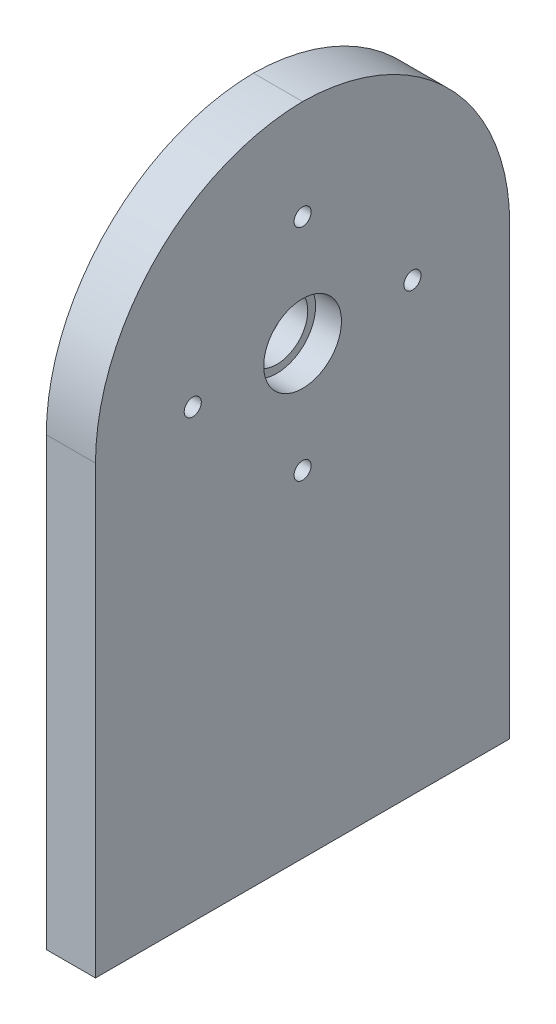
ISO-10303-21;
HEADER;
FILE_DESCRIPTION(('STEP AP214'),'2;1');
FILE_NAME('part.step','',(''),(''),'','','');
FILE_SCHEMA(('AUTOMOTIVE_DESIGN { 1 0 10303 214 1 1 1 1 }'));
ENDSEC;
DATA;
#1=APPLICATION_CONTEXT('core data for automotive mechanical design processes');
#2=APPLICATION_PROTOCOL_DEFINITION('international standard','automotive_design',2000,#1);
#3=PRODUCT_CONTEXT('',#1,'mechanical');
#4=PRODUCT('Part','Part','',(#3));
#5=PRODUCT_RELATED_PRODUCT_CATEGORY('part','',(#4));
#6=PRODUCT_DEFINITION_FORMATION('','',#4);
#7=PRODUCT_DEFINITION_CONTEXT('part definition',#1,'design');
#8=PRODUCT_DEFINITION('design','',#6,#7);
#9=PRODUCT_DEFINITION_SHAPE('','',#8);
#10=(LENGTH_UNIT() NAMED_UNIT(*) SI_UNIT(.MILLI.,.METRE.));
#11=(NAMED_UNIT(*) PLANE_ANGLE_UNIT() SI_UNIT($,.RADIAN.));
#12=(NAMED_UNIT(*) SI_UNIT($,.STERADIAN.) SOLID_ANGLE_UNIT());
#13=UNCERTAINTY_MEASURE_WITH_UNIT(LENGTH_MEASURE(1.E-05),#10,'distance_accuracy_value','');
#14=(GEOMETRIC_REPRESENTATION_CONTEXT(3) GLOBAL_UNCERTAINTY_ASSIGNED_CONTEXT((#13)) GLOBAL_UNIT_ASSIGNED_CONTEXT((#10,
#11,#12)) REPRESENTATION_CONTEXT('',''));
#15=CARTESIAN_POINT('',(0.,0.,0.));
#16=DIRECTION('',(0.,0.,1.));
#17=DIRECTION('',(1.,0.,0.));
#18=AXIS2_PLACEMENT_3D('',#15,#16,#17);
#19=CARTESIAN_POINT('',(144.666666666667,10.,39.6428499928494));
#20=DIRECTION('',(0.,1.,0.));
#21=DIRECTION('',(0.,0.,1.));
#22=AXIS2_PLACEMENT_3D('',#19,#20,#21);
#23=PLANE('',#22);
#24=CARTESIAN_POINT('',(-64.,10.,30.));
#25=DIRECTION('',(0.,-1.,0.));
#26=DIRECTION('',(0.,0.,-1.));
#27=AXIS2_PLACEMENT_3D('',#24,#25,#26);
#28=CIRCLE('',#27,1.64999999999999);
#29=CARTESIAN_POINT('',(-64.,10.,28.35));
#30=VERTEX_POINT('',#29);
#31=EDGE_CURVE('E160',#30,#30,#28,.T.);
#32=ORIENTED_EDGE('',*,*,#31,.F.);
#33=EDGE_LOOP('',(#32));
#34=FACE_BOUND('',#33,.T.);
#35=CARTESIAN_POINT('',(-64.,10.,0.));
#36=DIRECTION('',(0.,-1.,0.));
#37=DIRECTION('',(0.,0.,-1.));
#38=AXIS2_PLACEMENT_3D('',#35,#36,#37);
#39=CIRCLE('',#38,1.64999999999999);
#40=CARTESIAN_POINT('',(-64.,10.,-1.64999999999999));
#41=VERTEX_POINT('',#40);
#42=EDGE_CURVE('E168',#41,#41,#39,.T.);
#43=ORIENTED_EDGE('',*,*,#42,.F.);
#44=EDGE_LOOP('',(#43));
#45=FACE_BOUND('',#44,.T.);
#46=CARTESIAN_POINT('',(-64.,10.,-30.));
#47=DIRECTION('',(0.,-1.,0.));
#48=DIRECTION('',(0.,0.,-1.));
#49=AXIS2_PLACEMENT_3D('',#46,#47,#48);
#50=CIRCLE('',#49,1.64999999999999);
#51=CARTESIAN_POINT('',(-64.,10.,-31.65));
#52=VERTEX_POINT('',#51);
#53=EDGE_CURVE('E176',#52,#52,#50,.T.);
#54=ORIENTED_EDGE('',*,*,#53,.F.);
#55=EDGE_LOOP('',(#54));
#56=FACE_BOUND('',#55,.T.);
#57=DIRECTION('',(0.,0.,-1.));
#58=VECTOR('',#57,1.);
#59=CARTESIAN_POINT('',(-60.,10.,-40.00000001));
#60=LINE('',#59,#58);
#61=CARTESIAN_POINT('',(-60.,10.,40.00000001));
#62=VERTEX_POINT('',#61);
#63=CARTESIAN_POINT('',(-60.,10.,-40.00000001));
#64=VERTEX_POINT('',#63);
#65=EDGE_CURVE('E49',#62,#64,#60,.T.);
#66=ORIENTED_EDGE('',*,*,#65,.F.);
#67=DIRECTION('',(1.,0.,0.));
#68=VECTOR('',#67,1.);
#69=CARTESIAN_POINT('',(-68.,10.,40.00000001));
#70=LINE('',#69,#68);
#71=CARTESIAN_POINT('',(-69.5,10.,40.00000001));
#72=VERTEX_POINT('',#71);
#73=EDGE_CURVE('E102',#72,#62,#70,.T.);
#74=ORIENTED_EDGE('',*,*,#73,.F.);
#75=DIRECTION('',(0.,0.,1.));
#76=VECTOR('',#75,1.);
#77=CARTESIAN_POINT('',(-69.5,10.,-40.00000001));
#78=LINE('',#77,#76);
#79=CARTESIAN_POINT('',(-69.5,10.,-40.00000001));
#80=VERTEX_POINT('',#79);
#81=EDGE_CURVE('E105',#80,#72,#78,.T.);
#82=ORIENTED_EDGE('',*,*,#81,.F.);
#83=DIRECTION('',(-1.,0.,0.));
#84=VECTOR('',#83,1.);
#85=CARTESIAN_POINT('',(-68.,10.,-40.00000001));
#86=LINE('',#85,#84);
#87=EDGE_CURVE('E201',#64,#80,#86,.T.);
#88=ORIENTED_EDGE('',*,*,#87,.F.);
#89=EDGE_LOOP('',(#66,#74,#82,#88));
#90=FACE_BOUND('',#89,.T.);
#91=ADVANCED_FACE('F45',(#34,#45,#56,#90),#23,.F.);
#92=CARTESIAN_POINT('',(-60.,136.594137144615,0.));
#93=DIRECTION('',(1.,0.,0.));
#94=DIRECTION('',(0.,0.,-1.));
#95=AXIS2_PLACEMENT_3D('',#92,#93,#94);
#96=PLANE('',#95);
#97=CARTESIAN_POINT('',(-60.,117.330186529938,0.));
#98=DIRECTION('',(1.,0.,0.));
#99=DIRECTION('',(0.,0.,-1.));
#100=AXIS2_PLACEMENT_3D('',#97,#98,#99);
#101=CIRCLE('',#100,1.65);
#102=CARTESIAN_POINT('',(-60.,117.330186529938,-1.64999999999997));
#103=VERTEX_POINT('',#102);
#104=EDGE_CURVE('E144',#103,#103,#101,.T.);
#105=ORIENTED_EDGE('',*,*,#104,.F.);
#106=EDGE_LOOP('',(#105));
#107=FACE_BOUND('',#106,.T.);
#108=CARTESIAN_POINT('',(-60.,74.9037796587448,0.));
#109=DIRECTION('',(1.,0.,0.));
#110=DIRECTION('',(0.,0.,-1.));
#111=AXIS2_PLACEMENT_3D('',#108,#109,#110);
#112=CIRCLE('',#111,1.65);
#113=CARTESIAN_POINT('',(-60.,74.9037796587448,-1.64999999999997));
#114=VERTEX_POINT('',#113);
#115=EDGE_CURVE('E148',#114,#114,#112,.T.);
#116=ORIENTED_EDGE('',*,*,#115,.F.);
#117=EDGE_LOOP('',(#116));
#118=FACE_BOUND('',#117,.T.);
#119=CARTESIAN_POINT('',(-60.,96.1169830943412,-21.2132034355964));
#120=DIRECTION('',(1.,0.,0.));
#121=DIRECTION('',(0.,0.,-1.));
#122=AXIS2_PLACEMENT_3D('',#119,#120,#121);
#123=CIRCLE('',#122,1.65);
#124=CARTESIAN_POINT('',(-60.,96.1169830943412,-22.8632034355964));
#125=VERTEX_POINT('',#124);
#126=EDGE_CURVE('E152',#125,#125,#123,.T.);
#127=ORIENTED_EDGE('',*,*,#126,.F.);
#128=EDGE_LOOP('',(#127));
#129=FACE_BOUND('',#128,.T.);
#130=CARTESIAN_POINT('',(-60.,96.1169830943412,21.2132034355964));
#131=DIRECTION('',(1.,0.,0.));
#132=DIRECTION('',(0.,0.,-1.));
#133=AXIS2_PLACEMENT_3D('',#130,#131,#132);
#134=CIRCLE('',#133,1.65);
#135=CARTESIAN_POINT('',(-60.,96.1169830943412,19.5632034355964));
#136=VERTEX_POINT('',#135);
#137=EDGE_CURVE('E156',#136,#136,#134,.T.);
#138=ORIENTED_EDGE('',*,*,#137,.F.);
#139=EDGE_LOOP('',(#138));
#140=FACE_BOUND('',#139,.T.);
#141=CARTESIAN_POINT('',(-60.,96.1169830943412,0.));
#142=DIRECTION('',(1.,0.,0.));
#143=DIRECTION('',(0.,0.,-1.));
#144=AXIS2_PLACEMENT_3D('',#141,#142,#143);
#145=CIRCLE('',#144,7.509);
#146=CARTESIAN_POINT('',(-60.,96.1169830943412,-7.50899999999999));
#147=VERTEX_POINT('',#146);
#148=EDGE_CURVE('E188',#147,#147,#145,.T.);
#149=ORIENTED_EDGE('',*,*,#148,.F.);
#150=EDGE_LOOP('',(#149));
#151=FACE_BOUND('',#150,.T.);
#152=CARTESIAN_POINT('',(-60.,96.1169830943412,0.479999989999987));
#153=DIRECTION('',(-1.,0.,0.));
#154=DIRECTION('',(0.,0.,1.));
#155=AXIS2_PLACEMENT_3D('',#152,#153,#154);
#156=CIRCLE('',#155,40.48);
#157=CARTESIAN_POINT('',(-60.,96.1169830943412,-40.00000001));
#158=VERTEX_POINT('',#157);
#159=CARTESIAN_POINT('',(-60.,136.594137144615,0.));
#160=VERTEX_POINT('',#159);
#161=EDGE_CURVE('E11',#158,#160,#156,.F.);
#162=ORIENTED_EDGE('',*,*,#161,.T.);
#163=CARTESIAN_POINT('',(-60.,96.1169830943412,-0.479999990000028));
#164=DIRECTION('',(-1.,0.,0.));
#165=DIRECTION('',(0.,0.,1.));
#166=AXIS2_PLACEMENT_3D('',#163,#164,#165);
#167=CIRCLE('',#166,40.48);
#168=CARTESIAN_POINT('',(-60.,96.1169830943412,40.00000001));
#169=VERTEX_POINT('',#168);
#170=EDGE_CURVE('E55',#160,#169,#167,.F.);
#171=ORIENTED_EDGE('',*,*,#170,.T.);
#172=DIRECTION('',(0.,-1.,0.));
#173=VECTOR('',#172,1.);
#174=CARTESIAN_POINT('',(-60.,136.596983094341,40.00000001));
#175=LINE('',#174,#173);
#176=EDGE_CURVE('E202',#169,#62,#175,.T.);
#177=ORIENTED_EDGE('',*,*,#176,.T.);
#178=ORIENTED_EDGE('',*,*,#65,.T.);
#179=DIRECTION('',(0.,-1.,0.));
#180=VECTOR('',#179,1.);
#181=CARTESIAN_POINT('',(-60.,136.596983094341,-40.00000001));
#182=LINE('',#181,#180);
#183=EDGE_CURVE('E196',#158,#64,#182,.T.);
#184=ORIENTED_EDGE('',*,*,#183,.F.);
#185=EDGE_LOOP('',(#162,#171,#177,#178,#184));
#186=FACE_BOUND('',#185,.T.);
#187=ADVANCED_FACE('F47',(#107,#118,#129,#140,#151,#186),#96,.T.);
#188=CARTESIAN_POINT('',(-68.,136.596983094341,-40.00000001));
#189=DIRECTION('',(0.,0.,1.));
#190=DIRECTION('',(1.,0.,0.));
#191=AXIS2_PLACEMENT_3D('',#188,#189,#190);
#192=PLANE('',#191);
#193=ORIENTED_EDGE('',*,*,#87,.T.);
#194=DIRECTION('',(0.,-1.,0.));
#195=VECTOR('',#194,1.);
#196=CARTESIAN_POINT('',(-69.5,96.1169830943412,-40.00000001));
#197=LINE('',#196,#195);
#198=CARTESIAN_POINT('',(-69.5,96.1169830943412,-40.00000001));
#199=VERTEX_POINT('',#198);
#200=EDGE_CURVE('E127',#199,#80,#197,.T.);
#201=ORIENTED_EDGE('',*,*,#200,.F.);
#202=DIRECTION('',(-1.,0.,0.));
#203=VECTOR('',#202,1.);
#204=CARTESIAN_POINT('',(-60.,96.1169830943412,-40.00000001));
#205=LINE('',#204,#203);
#206=EDGE_CURVE('E200',#199,#158,#205,.F.);
#207=ORIENTED_EDGE('',*,*,#206,.T.);
#208=ORIENTED_EDGE('',*,*,#183,.T.);
#209=EDGE_LOOP('',(#193,#201,#207,#208));
#210=FACE_BOUND('',#209,.T.);
#211=ADVANCED_FACE('F214',(#210),#192,.F.);
#212=CARTESIAN_POINT('',(0.,96.1169830943412,0.479999989999987));
#213=DIRECTION('',(1.,0.,0.));
#214=DIRECTION('',(0.,0.,-1.));
#215=AXIS2_PLACEMENT_3D('',#212,#213,#214);
#216=CYLINDRICAL_SURFACE('',#215,40.48);
#217=ORIENTED_EDGE('',*,*,#206,.F.);
#218=CARTESIAN_POINT('',(-69.5,96.1169830943412,0.479999989999987));
#219=DIRECTION('',(-1.,0.,0.));
#220=DIRECTION('',(0.,0.,1.));
#221=AXIS2_PLACEMENT_3D('',#218,#219,#220);
#222=CIRCLE('',#221,40.48);
#223=CARTESIAN_POINT('',(-69.5,136.594137144615,0.));
#224=VERTEX_POINT('',#223);
#225=EDGE_CURVE('E139',#224,#199,#222,.T.);
#226=ORIENTED_EDGE('',*,*,#225,.F.);
#227=DIRECTION('',(1.,0.,0.));
#228=VECTOR('',#227,1.);
#229=CARTESIAN_POINT('',(-64.,136.594137144615,0.));
#230=LINE('',#229,#228);
#231=EDGE_CURVE('E110',#160,#224,#230,.F.);
#232=ORIENTED_EDGE('',*,*,#231,.F.);
#233=ORIENTED_EDGE('',*,*,#161,.F.);
#234=EDGE_LOOP('',(#217,#226,#232,#233));
#235=FACE_BOUND('',#234,.T.);
#236=ADVANCED_FACE('F220',(#235),#216,.T.);
#237=CARTESIAN_POINT('',(-68.,136.596983094341,40.00000001));
#238=DIRECTION('',(0.,0.,-1.));
#239=DIRECTION('',(-1.,0.,0.));
#240=AXIS2_PLACEMENT_3D('',#237,#238,#239);
#241=PLANE('',#240);
#242=ORIENTED_EDGE('',*,*,#176,.F.);
#243=DIRECTION('',(1.,0.,0.));
#244=VECTOR('',#243,1.);
#245=CARTESIAN_POINT('',(-68.,96.1169830943412,40.00000001));
#246=LINE('',#245,#244);
#247=CARTESIAN_POINT('',(-69.5,96.1169830943412,40.00000001));
#248=VERTEX_POINT('',#247);
#249=EDGE_CURVE('E109',#169,#248,#246,.F.);
#250=ORIENTED_EDGE('',*,*,#249,.T.);
#251=DIRECTION('',(0.,1.,0.));
#252=VECTOR('',#251,1.);
#253=CARTESIAN_POINT('',(-69.5,10.,40.00000001));
#254=LINE('',#253,#252);
#255=EDGE_CURVE('E113',#72,#248,#254,.T.);
#256=ORIENTED_EDGE('',*,*,#255,.F.);
#257=ORIENTED_EDGE('',*,*,#73,.T.);
#258=EDGE_LOOP('',(#242,#250,#256,#257));
#259=FACE_BOUND('',#258,.T.);
#260=ADVANCED_FACE('F114',(#259),#241,.F.);
#261=CARTESIAN_POINT('',(0.,96.1169830943412,-0.479999990000028));
#262=DIRECTION('',(-1.,0.,0.));
#263=DIRECTION('',(0.,0.,1.));
#264=AXIS2_PLACEMENT_3D('',#261,#262,#263);
#265=CYLINDRICAL_SURFACE('',#264,40.48);
#266=ORIENTED_EDGE('',*,*,#231,.T.);
#267=CARTESIAN_POINT('',(-69.5,96.1169830943412,-0.479999990000028));
#268=DIRECTION('',(-1.,0.,0.));
#269=DIRECTION('',(0.,0.,1.));
#270=AXIS2_PLACEMENT_3D('',#267,#268,#269);
#271=CIRCLE('',#270,40.48);
#272=EDGE_CURVE('E120',#248,#224,#271,.T.);
#273=ORIENTED_EDGE('',*,*,#272,.F.);
#274=ORIENTED_EDGE('',*,*,#249,.F.);
#275=ORIENTED_EDGE('',*,*,#170,.F.);
#276=EDGE_LOOP('',(#266,#273,#274,#275));
#277=FACE_BOUND('',#276,.T.);
#278=ADVANCED_FACE('F217',(#277),#265,.T.);
#279=CARTESIAN_POINT('',(-65.,96.1169830943412,0.));
#280=DIRECTION('',(1.,0.,0.));
#281=DIRECTION('',(0.,0.,-1.));
#282=AXIS2_PLACEMENT_3D('',#279,#280,#281);
#283=CYLINDRICAL_SURFACE('',#282,7.509);
#284=CARTESIAN_POINT('',(-65.,96.1169830943412,0.));
#285=DIRECTION('',(1.,0.,0.));
#286=DIRECTION('',(0.,0.,-1.));
#287=AXIS2_PLACEMENT_3D('',#284,#285,#286);
#288=CIRCLE('',#287,7.509);
#289=CARTESIAN_POINT('',(-65.,96.1169830943412,-7.50899999999999));
#290=VERTEX_POINT('',#289);
#291=EDGE_CURVE('E189',#290,#290,#288,.T.);
#292=ORIENTED_EDGE('',*,*,#291,.F.);
#293=EDGE_LOOP('',(#292));
#294=FACE_BOUND('',#293,.T.);
#295=ORIENTED_EDGE('',*,*,#148,.T.);
#296=EDGE_LOOP('',(#295));
#297=FACE_BOUND('',#296,.T.);
#298=ADVANCED_FACE('F236',(#294,#297),#283,.F.);
#299=CARTESIAN_POINT('',(-65.,96.1169830943412,0.));
#300=DIRECTION('',(1.,0.,0.));
#301=DIRECTION('',(0.,0.,-1.));
#302=AXIS2_PLACEMENT_3D('',#299,#300,#301);
#303=PLANE('',#302);
#304=CARTESIAN_POINT('',(-65.,96.1169830943412,0.));
#305=DIRECTION('',(1.,0.,0.));
#306=DIRECTION('',(0.,0.,-1.));
#307=AXIS2_PLACEMENT_3D('',#304,#305,#306);
#308=CIRCLE('',#307,6.);
#309=CARTESIAN_POINT('',(-65.,96.1169830943412,-5.99999999999999));
#310=VERTEX_POINT('',#309);
#311=EDGE_CURVE('E184',#310,#310,#308,.T.);
#312=ORIENTED_EDGE('',*,*,#311,.F.);
#313=EDGE_LOOP('',(#312));
#314=FACE_BOUND('',#313,.T.);
#315=ORIENTED_EDGE('',*,*,#291,.T.);
#316=EDGE_LOOP('',(#315));
#317=FACE_BOUND('',#316,.T.);
#318=ADVANCED_FACE('F264',(#314,#317),#303,.T.);
#319=CARTESIAN_POINT('',(-68.,96.1169830943412,0.));
#320=DIRECTION('',(1.,0.,0.));
#321=DIRECTION('',(0.,0.,-1.));
#322=AXIS2_PLACEMENT_3D('',#319,#320,#321);
#323=CYLINDRICAL_SURFACE('',#322,6.);
#324=ORIENTED_EDGE('',*,*,#311,.T.);
#325=EDGE_LOOP('',(#324));
#326=FACE_BOUND('',#325,.T.);
#327=CARTESIAN_POINT('',(-69.5,96.1169830943412,0.));
#328=DIRECTION('',(-1.,0.,0.));
#329=DIRECTION('',(0.,0.,1.));
#330=AXIS2_PLACEMENT_3D('',#327,#328,#329);
#331=CIRCLE('',#330,6.00000000000001);
#332=CARTESIAN_POINT('',(-69.5,96.1169830943412,6.00000000000002));
#333=VERTEX_POINT('',#332);
#334=EDGE_CURVE('E468',#333,#333,#331,.T.);
#335=ORIENTED_EDGE('',*,*,#334,.T.);
#336=EDGE_LOOP('',(#335));
#337=FACE_BOUND('',#336,.T.);
#338=ADVANCED_FACE('F256',(#326,#337),#323,.F.);
#339=CARTESIAN_POINT('',(-64.,45.,-30.));
#340=DIRECTION('',(0.,-1.,0.));
#341=DIRECTION('',(0.,0.,-1.));
#342=AXIS2_PLACEMENT_3D('',#339,#340,#341);
#343=CONICAL_SURFACE('',#342,1.64999999999998,1.02974425867665);
#344=CARTESIAN_POINT('',(-64.,45.9914200213955,-30.));
#345=VERTEX_POINT('',#344);
#346=VERTEX_LOOP('',#345);
#347=FACE_BOUND('',#346,.T.);
#348=CARTESIAN_POINT('',(-64.,45.,-30.));
#349=DIRECTION('',(0.,-1.,0.));
#350=DIRECTION('',(0.,0.,-1.));
#351=AXIS2_PLACEMENT_3D('',#348,#349,#350);
#352=CIRCLE('',#351,1.64999999999998);
#353=CARTESIAN_POINT('',(-64.,45.,-31.65));
#354=VERTEX_POINT('',#353);
#355=EDGE_CURVE('E180',#354,#354,#352,.T.);
#356=ORIENTED_EDGE('',*,*,#355,.T.);
#357=EDGE_LOOP('',(#356));
#358=FACE_BOUND('',#357,.T.);
#359=ADVANCED_FACE('F246',(#347,#358),#343,.F.);
#360=CARTESIAN_POINT('',(-64.,10.,-30.));
#361=DIRECTION('',(0.,-1.,0.));
#362=DIRECTION('',(0.,0.,-1.));
#363=AXIS2_PLACEMENT_3D('',#360,#361,#362);
#364=CYLINDRICAL_SURFACE('',#363,1.64999999999999);
#365=ORIENTED_EDGE('',*,*,#355,.F.);
#366=EDGE_LOOP('',(#365));
#367=FACE_BOUND('',#366,.T.);
#368=ORIENTED_EDGE('',*,*,#53,.T.);
#369=EDGE_LOOP('',(#368));
#370=FACE_BOUND('',#369,.T.);
#371=ADVANCED_FACE('F243',(#367,#370),#364,.F.);
#372=CARTESIAN_POINT('',(-64.,45.,0.));
#373=DIRECTION('',(0.,-1.,0.));
#374=DIRECTION('',(0.,0.,-1.));
#375=AXIS2_PLACEMENT_3D('',#372,#373,#374);
#376=CONICAL_SURFACE('',#375,1.64999999999998,1.02974425867665);
#377=CARTESIAN_POINT('',(-64.,45.9914200213955,0.));
#378=VERTEX_POINT('',#377);
#379=VERTEX_LOOP('',#378);
#380=FACE_BOUND('',#379,.T.);
#381=CARTESIAN_POINT('',(-64.,45.,0.));
#382=DIRECTION('',(0.,-1.,0.));
#383=DIRECTION('',(0.,0.,-1.));
#384=AXIS2_PLACEMENT_3D('',#381,#382,#383);
#385=CIRCLE('',#384,1.64999999999998);
#386=CARTESIAN_POINT('',(-64.,45.,-1.64999999999998));
#387=VERTEX_POINT('',#386);
#388=EDGE_CURVE('E172',#387,#387,#385,.T.);
#389=ORIENTED_EDGE('',*,*,#388,.T.);
#390=EDGE_LOOP('',(#389));
#391=FACE_BOUND('',#390,.T.);
#392=ADVANCED_FACE('F245',(#380,#391),#376,.F.);
#393=CARTESIAN_POINT('',(-64.,10.,0.));
#394=DIRECTION('',(0.,-1.,0.));
#395=DIRECTION('',(0.,0.,-1.));
#396=AXIS2_PLACEMENT_3D('',#393,#394,#395);
#397=CYLINDRICAL_SURFACE('',#396,1.64999999999999);
#398=ORIENTED_EDGE('',*,*,#388,.F.);
#399=EDGE_LOOP('',(#398));
#400=FACE_BOUND('',#399,.T.);
#401=ORIENTED_EDGE('',*,*,#42,.T.);
#402=EDGE_LOOP('',(#401));
#403=FACE_BOUND('',#402,.T.);
#404=ADVANCED_FACE('F253',(#400,#403),#397,.F.);
#405=CARTESIAN_POINT('',(-64.,45.,30.));
#406=DIRECTION('',(0.,-1.,0.));
#407=DIRECTION('',(0.,0.,-1.));
#408=AXIS2_PLACEMENT_3D('',#405,#406,#407);
#409=CONICAL_SURFACE('',#408,1.64999999999998,1.02974425867665);
#410=CARTESIAN_POINT('',(-64.,45.9914200213955,30.));
#411=VERTEX_POINT('',#410);
#412=VERTEX_LOOP('',#411);
#413=FACE_BOUND('',#412,.T.);
#414=CARTESIAN_POINT('',(-64.,45.,30.));
#415=DIRECTION('',(0.,-1.,0.));
#416=DIRECTION('',(0.,0.,-1.));
#417=AXIS2_PLACEMENT_3D('',#414,#415,#416);
#418=CIRCLE('',#417,1.64999999999998);
#419=CARTESIAN_POINT('',(-64.,45.,28.35));
#420=VERTEX_POINT('',#419);
#421=EDGE_CURVE('E164',#420,#420,#418,.T.);
#422=ORIENTED_EDGE('',*,*,#421,.T.);
#423=EDGE_LOOP('',(#422));
#424=FACE_BOUND('',#423,.T.);
#425=ADVANCED_FACE('F351',(#413,#424),#409,.F.);
#426=CARTESIAN_POINT('',(-64.,10.,30.));
#427=DIRECTION('',(0.,-1.,0.));
#428=DIRECTION('',(0.,0.,-1.));
#429=AXIS2_PLACEMENT_3D('',#426,#427,#428);
#430=CYLINDRICAL_SURFACE('',#429,1.64999999999999);
#431=ORIENTED_EDGE('',*,*,#421,.F.);
#432=EDGE_LOOP('',(#431));
#433=FACE_BOUND('',#432,.T.);
#434=ORIENTED_EDGE('',*,*,#31,.T.);
#435=EDGE_LOOP('',(#434));
#436=FACE_BOUND('',#435,.T.);
#437=ADVANCED_FACE('F290',(#433,#436),#430,.F.);
#438=CARTESIAN_POINT('',(-68.,96.1169830943412,21.2132034355964));
#439=DIRECTION('',(-1.,0.,0.));
#440=DIRECTION('',(0.,0.,1.));
#441=AXIS2_PLACEMENT_3D('',#438,#439,#440);
#442=CYLINDRICAL_SURFACE('',#441,1.65);
#443=ORIENTED_EDGE('',*,*,#137,.T.);
#444=EDGE_LOOP('',(#443));
#445=FACE_BOUND('',#444,.T.);
#446=CARTESIAN_POINT('',(-69.5,96.1169830943412,21.2132034355964));
#447=DIRECTION('',(-1.,0.,0.));
#448=DIRECTION('',(0.,0.,1.));
#449=AXIS2_PLACEMENT_3D('',#446,#447,#448);
#450=CIRCLE('',#449,1.65);
#451=CARTESIAN_POINT('',(-69.5,96.1169830943412,22.8632034355964));
#452=VERTEX_POINT('',#451);
#453=EDGE_CURVE('E133',#452,#452,#450,.T.);
#454=ORIENTED_EDGE('',*,*,#453,.T.);
#455=EDGE_LOOP('',(#454));
#456=FACE_BOUND('',#455,.T.);
#457=ADVANCED_FACE('F286',(#445,#456),#442,.F.);
#458=CARTESIAN_POINT('',(-68.,96.1169830943412,-21.2132034355964));
#459=DIRECTION('',(-1.,0.,0.));
#460=DIRECTION('',(0.,0.,1.));
#461=AXIS2_PLACEMENT_3D('',#458,#459,#460);
#462=CYLINDRICAL_SURFACE('',#461,1.65);
#463=ORIENTED_EDGE('',*,*,#126,.T.);
#464=EDGE_LOOP('',(#463));
#465=FACE_BOUND('',#464,.T.);
#466=CARTESIAN_POINT('',(-69.5,96.1169830943412,-21.2132034355964));
#467=DIRECTION('',(-1.,0.,0.));
#468=DIRECTION('',(0.,0.,1.));
#469=AXIS2_PLACEMENT_3D('',#466,#467,#468);
#470=CIRCLE('',#469,1.65);
#471=CARTESIAN_POINT('',(-69.5,96.1169830943412,-19.5632034355964));
#472=VERTEX_POINT('',#471);
#473=EDGE_CURVE('E463',#472,#472,#470,.T.);
#474=ORIENTED_EDGE('',*,*,#473,.T.);
#475=EDGE_LOOP('',(#474));
#476=FACE_BOUND('',#475,.T.);
#477=ADVANCED_FACE('F289',(#465,#476),#462,.F.);
#478=CARTESIAN_POINT('',(-68.,74.9037796587448,0.));
#479=DIRECTION('',(-1.,0.,0.));
#480=DIRECTION('',(0.,0.,1.));
#481=AXIS2_PLACEMENT_3D('',#478,#479,#480);
#482=CYLINDRICAL_SURFACE('',#481,1.65);
#483=ORIENTED_EDGE('',*,*,#115,.T.);
#484=EDGE_LOOP('',(#483));
#485=FACE_BOUND('',#484,.T.);
#486=CARTESIAN_POINT('',(-69.5,74.9037796587448,0.));
#487=DIRECTION('',(-1.,0.,0.));
#488=DIRECTION('',(0.,0.,1.));
#489=AXIS2_PLACEMENT_3D('',#486,#487,#488);
#490=CIRCLE('',#489,1.65);
#491=CARTESIAN_POINT('',(-69.5,74.9037796587448,1.65000000000003));
#492=VERTEX_POINT('',#491);
#493=EDGE_CURVE('E475',#492,#492,#490,.T.);
#494=ORIENTED_EDGE('',*,*,#493,.T.);
#495=EDGE_LOOP('',(#494));
#496=FACE_BOUND('',#495,.T.);
#497=ADVANCED_FACE('F299',(#485,#496),#482,.F.);
#498=CARTESIAN_POINT('',(-68.,117.330186529938,0.));
#499=DIRECTION('',(-1.,0.,0.));
#500=DIRECTION('',(0.,0.,1.));
#501=AXIS2_PLACEMENT_3D('',#498,#499,#500);
#502=CYLINDRICAL_SURFACE('',#501,1.65);
#503=ORIENTED_EDGE('',*,*,#104,.T.);
#504=EDGE_LOOP('',(#503));
#505=FACE_BOUND('',#504,.T.);
#506=CARTESIAN_POINT('',(-69.5,117.330186529938,0.));
#507=DIRECTION('',(-1.,0.,0.));
#508=DIRECTION('',(0.,0.,1.));
#509=AXIS2_PLACEMENT_3D('',#506,#507,#508);
#510=CIRCLE('',#509,1.65);
#511=CARTESIAN_POINT('',(-69.5,117.330186529938,1.65000000000002));
#512=VERTEX_POINT('',#511);
#513=EDGE_CURVE('E129',#512,#512,#510,.T.);
#514=ORIENTED_EDGE('',*,*,#513,.T.);
#515=EDGE_LOOP('',(#514));
#516=FACE_BOUND('',#515,.T.);
#517=ADVANCED_FACE('F308',(#505,#516),#502,.F.);
#518=CARTESIAN_POINT('',(-69.5,96.1169830943412,-0.479999990000028));
#519=DIRECTION('',(-1.,0.,0.));
#520=DIRECTION('',(0.,0.,1.));
#521=AXIS2_PLACEMENT_3D('',#518,#519,#520);
#522=PLANE('',#521);
#523=ORIENTED_EDGE('',*,*,#473,.F.);
#524=EDGE_LOOP('',(#523));
#525=FACE_BOUND('',#524,.T.);
#526=ORIENTED_EDGE('',*,*,#453,.F.);
#527=EDGE_LOOP('',(#526));
#528=FACE_BOUND('',#527,.T.);
#529=ORIENTED_EDGE('',*,*,#81,.T.);
#530=ORIENTED_EDGE('',*,*,#255,.T.);
#531=ORIENTED_EDGE('',*,*,#272,.T.);
#532=ORIENTED_EDGE('',*,*,#225,.T.);
#533=ORIENTED_EDGE('',*,*,#200,.T.);
#534=EDGE_LOOP('',(#529,#530,#531,#532,#533));
#535=FACE_BOUND('',#534,.T.);
#536=ORIENTED_EDGE('',*,*,#513,.F.);
#537=EDGE_LOOP('',(#536));
#538=FACE_BOUND('',#537,.T.);
#539=ORIENTED_EDGE('',*,*,#334,.F.);
#540=EDGE_LOOP('',(#539));
#541=FACE_BOUND('',#540,.T.);
#542=ORIENTED_EDGE('',*,*,#493,.F.);
#543=EDGE_LOOP('',(#542));
#544=FACE_BOUND('',#543,.T.);
#545=ADVANCED_FACE('F123',(#525,#528,#535,#538,#541,#544),#522,.T.);
#546=CLOSED_SHELL('',(#91,#187,#211,#236,#260,#278,#298,#318,#338,#359,#371,#392,#404,#425,#437,
#457,#477,#497,#517,#545));
#547=MANIFOLD_SOLID_BREP('B2',#546);
#548=ADVANCED_BREP_SHAPE_REPRESENTATION('',(#18,#547),#14);
#549=SHAPE_DEFINITION_REPRESENTATION(#9,#548);
ENDSEC;
END-ISO-10303-21;
